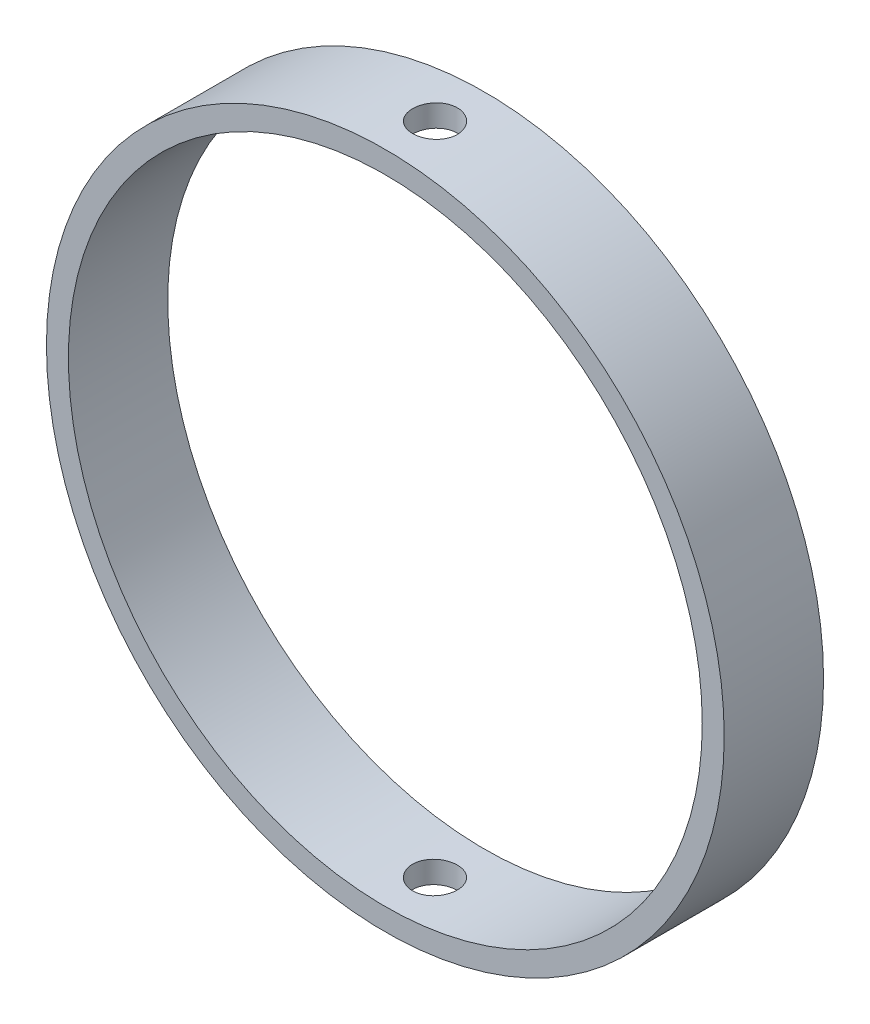
ISO-10303-21;
HEADER;
FILE_DESCRIPTION(('STEP AP214'),'2;1');
FILE_NAME('part.step','',(''),(''),'','','');
FILE_SCHEMA(('AUTOMOTIVE_DESIGN { 1 0 10303 214 1 1 1 1 }'));
ENDSEC;
DATA;
#1=APPLICATION_CONTEXT('core data for automotive mechanical design processes');
#2=APPLICATION_PROTOCOL_DEFINITION('international standard','automotive_design',2000,#1);
#3=PRODUCT_CONTEXT('',#1,'mechanical');
#4=PRODUCT('Part','Part','',(#3));
#5=PRODUCT_RELATED_PRODUCT_CATEGORY('part','',(#4));
#6=PRODUCT_DEFINITION_FORMATION('','',#4);
#7=PRODUCT_DEFINITION_CONTEXT('part definition',#1,'design');
#8=PRODUCT_DEFINITION('design','',#6,#7);
#9=PRODUCT_DEFINITION_SHAPE('','',#8);
#10=(LENGTH_UNIT() NAMED_UNIT(*) SI_UNIT(.MILLI.,.METRE.));
#11=(NAMED_UNIT(*) PLANE_ANGLE_UNIT() SI_UNIT($,.RADIAN.));
#12=(NAMED_UNIT(*) SI_UNIT($,.STERADIAN.) SOLID_ANGLE_UNIT());
#13=UNCERTAINTY_MEASURE_WITH_UNIT(LENGTH_MEASURE(1.E-05),#10,'distance_accuracy_value','');
#14=(GEOMETRIC_REPRESENTATION_CONTEXT(3) GLOBAL_UNCERTAINTY_ASSIGNED_CONTEXT((#13)) GLOBAL_UNIT_ASSIGNED_CONTEXT((#10,
#11,#12)) REPRESENTATION_CONTEXT('',''));
#15=CARTESIAN_POINT('',(0.,0.,0.));
#16=DIRECTION('',(0.,0.,1.));
#17=DIRECTION('',(1.,0.,0.));
#18=AXIS2_PLACEMENT_3D('',#15,#16,#17);
#19=CARTESIAN_POINT('',(0.,0.,10.));
#20=DIRECTION('',(0.,0.,1.));
#21=DIRECTION('',(1.,0.,0.));
#22=AXIS2_PLACEMENT_3D('',#19,#20,#21);
#23=PLANE('',#22);
#24=CARTESIAN_POINT('',(0.,0.,10.));
#25=DIRECTION('',(0.,0.,1.));
#26=DIRECTION('',(1.,0.,0.));
#27=AXIS2_PLACEMENT_3D('',#24,#25,#26);
#28=CIRCLE('',#27,34.11);
#29=CARTESIAN_POINT('',(34.11,0.,10.));
#30=VERTEX_POINT('',#29);
#31=EDGE_CURVE('E10',#30,#30,#28,.T.);
#32=ORIENTED_EDGE('',*,*,#31,.T.);
#33=EDGE_LOOP('',(#32));
#34=FACE_BOUND('',#33,.T.);
#35=CARTESIAN_POINT('',(0.,0.,10.));
#36=DIRECTION('',(0.,0.,1.));
#37=DIRECTION('',(1.,0.,0.));
#38=AXIS2_PLACEMENT_3D('',#35,#36,#37);
#39=CIRCLE('',#38,31.9);
#40=CARTESIAN_POINT('',(31.9,0.,10.));
#41=VERTEX_POINT('',#40);
#42=EDGE_CURVE('E55',#41,#41,#39,.T.);
#43=ORIENTED_EDGE('',*,*,#42,.F.);
#44=EDGE_LOOP('',(#43));
#45=FACE_BOUND('',#44,.T.);
#46=ADVANCED_FACE('F36',(#34,#45),#23,.T.);
#47=CARTESIAN_POINT('',(0.,0.,0.));
#48=DIRECTION('',(0.,0.,1.));
#49=DIRECTION('',(1.,0.,0.));
#50=AXIS2_PLACEMENT_3D('',#47,#48,#49);
#51=PLANE('',#50);
#52=CARTESIAN_POINT('',(0.,0.,0.));
#53=DIRECTION('',(0.,0.,1.));
#54=DIRECTION('',(1.,0.,0.));
#55=AXIS2_PLACEMENT_3D('',#52,#53,#54);
#56=CIRCLE('',#55,34.11);
#57=CARTESIAN_POINT('',(34.11,0.,0.));
#58=VERTEX_POINT('',#57);
#59=EDGE_CURVE('E50',#58,#58,#56,.T.);
#60=ORIENTED_EDGE('',*,*,#59,.F.);
#61=EDGE_LOOP('',(#60));
#62=FACE_BOUND('',#61,.T.);
#63=CARTESIAN_POINT('',(0.,0.,0.));
#64=DIRECTION('',(0.,0.,1.));
#65=DIRECTION('',(1.,0.,0.));
#66=AXIS2_PLACEMENT_3D('',#63,#64,#65);
#67=CIRCLE('',#66,31.9);
#68=CARTESIAN_POINT('',(31.9,0.,0.));
#69=VERTEX_POINT('',#68);
#70=EDGE_CURVE('E58',#69,#69,#67,.T.);
#71=ORIENTED_EDGE('',*,*,#70,.T.);
#72=EDGE_LOOP('',(#71));
#73=FACE_BOUND('',#72,.T.);
#74=ADVANCED_FACE('F94',(#62,#73),#51,.F.);
#75=CARTESIAN_POINT('',(0.,0.,10.));
#76=DIRECTION('',(0.,0.,-1.));
#77=DIRECTION('',(-1.,0.,0.));
#78=AXIS2_PLACEMENT_3D('',#75,#76,#77);
#79=CYLINDRICAL_SURFACE('',#78,34.11);
#80=CARTESIAN_POINT('',(0.,-34.11,7.25));
#81=CARTESIAN_POINT('',(0.126236232067112,-34.1099990155322,7.24999445119093));
#82=CARTESIAN_POINT('',(0.252560495104078,-34.1092917357394,7.23934057154602));
#83=CARTESIAN_POINT('',(0.50171989079194,-34.1065382541149,7.19699363139113));
#84=CARTESIAN_POINT('',(0.624550805850633,-34.1044905000079,7.16527617855028));
#85=CARTESIAN_POINT('',(0.863078424326583,-34.0992876891452,7.08171796852339));
#86=CARTESIAN_POINT('',(0.978778893213271,-34.0961332228197,7.02988793982208));
#87=CARTESIAN_POINT('',(1.19980776719596,-34.0890716251194,6.90759350935407));
#88=CARTESIAN_POINT('',(1.30513851721244,-34.0851646645008,6.83713333379523));
#89=CARTESIAN_POINT('',(1.50264187295735,-34.0770299110278,6.67945155950877));
#90=CARTESIAN_POINT('',(1.59479506690922,-34.0728016586297,6.59220566835798));
#91=CARTESIAN_POINT('',(1.76316130484982,-34.064504782304,6.4034793961004));
#92=CARTESIAN_POINT('',(1.83937367791159,-34.0604361651012,6.30199841615874));
#93=CARTESIAN_POINT('',(1.97375593047256,-34.0529137938074,6.08757112706869));
#94=CARTESIAN_POINT('',(2.03190949037146,-34.0494605970605,5.9746145691447));
#95=CARTESIAN_POINT('',(2.12841896738848,-34.0435645020074,5.74051432500948));
#96=CARTESIAN_POINT('',(2.16677511733114,-34.0411215918201,5.61937073509959));
#97=CARTESIAN_POINT('',(2.2225465965421,-34.0375259775116,5.37252387964667));
#98=CARTESIAN_POINT('',(2.23999259764253,-34.0363713838091,5.24682757192913));
#99=CARTESIAN_POINT('',(2.25354324621545,-34.0354769504881,4.99428572088538));
#100=CARTESIAN_POINT('',(2.24964815860565,-34.0357370933078,4.86744019184455));
#101=CARTESIAN_POINT('',(2.22065263136083,-34.0376410428115,4.61640974726707));
#102=CARTESIAN_POINT('',(2.19558540316304,-34.0392826824118,4.49222097688771));
#103=CARTESIAN_POINT('',(2.12500868744147,-34.0437612178655,4.2498176945186));
#104=CARTESIAN_POINT('',(2.07949906606268,-34.0465981215455,4.13160322165366));
#105=CARTESIAN_POINT('',(1.96929178788083,-34.0531499881129,3.90439763600856));
#106=CARTESIAN_POINT('',(1.9045790896307,-34.0568656388432,3.79541383980074));
#107=CARTESIAN_POINT('',(1.75781350418989,-34.0647556021647,3.58984324955986));
#108=CARTESIAN_POINT('',(1.67576039913157,-34.0689299205185,3.49325661131118));
#109=CARTESIAN_POINT('',(1.49645624853778,-34.0772764412141,3.3150288655114));
#110=CARTESIAN_POINT('',(1.3991764650823,-34.0814486242749,3.23341666573886));
#111=CARTESIAN_POINT('',(1.19228104771026,-34.0893130552533,3.08767752418783));
#112=CARTESIAN_POINT('',(1.08266540900876,-34.0930053029847,3.02355058919169));
#113=CARTESIAN_POINT('',(0.854192149451793,-34.0994941584408,2.91460465771204));
#114=CARTESIAN_POINT('',(0.735333991988551,-34.1022907141147,2.86978678327523));
#115=CARTESIAN_POINT('',(0.491757589300713,-34.106672379113,2.80075063447031));
#116=CARTESIAN_POINT('',(0.367039420314796,-34.1082575041936,2.7765320921834));
#117=CARTESIAN_POINT('',(0.115534063197057,-34.1100356648865,2.74941796520279));
#118=CARTESIAN_POINT('',(-0.0112487991028989,-34.110231309442,2.74648241850394));
#119=CARTESIAN_POINT('',(-0.263505091974206,-34.1092154070142,2.76191315775841));
#120=CARTESIAN_POINT('',(-0.388978530143297,-34.1080038682005,2.78027932004229));
#121=CARTESIAN_POINT('',(-0.634941467304668,-34.104311646189,2.8377590358186));
#122=CARTESIAN_POINT('',(-0.755435275692361,-34.1018320863009,2.87685422708602));
#123=CARTESIAN_POINT('',(-0.988151655969573,-34.0958827186364,2.97466356712522));
#124=CARTESIAN_POINT('',(-1.10037414507042,-34.0924129009502,3.03337791223506));
#125=CARTESIAN_POINT('',(-1.31354513573504,-34.0848662599385,3.16886041266616));
#126=CARTESIAN_POINT('',(-1.41447666241317,-34.0807885436048,3.24565522614064));
#127=CARTESIAN_POINT('',(-1.6020297015385,-34.0724878953657,3.41507998108745));
#128=CARTESIAN_POINT('',(-1.68865105743697,-34.0682649618723,3.50771009577039));
#129=CARTESIAN_POINT('',(-1.84526051352104,-34.0601422489328,3.70634858290552));
#130=CARTESIAN_POINT('',(-1.91522266570183,-34.0562429796926,3.81237743685333));
#131=CARTESIAN_POINT('',(-2.03635019259243,-34.0492154796992,4.03470084009306));
#132=CARTESIAN_POINT('',(-2.08751569388909,-34.0460872437534,4.15099532024412));
#133=CARTESIAN_POINT('',(-2.16955269176884,-34.040958284317,4.39045445078552));
#134=CARTESIAN_POINT('',(-2.20044045422451,-34.0389566572967,4.51361350847123));
#135=CARTESIAN_POINT('',(-2.24109828405931,-34.0363041476612,4.76338328521924));
#136=CARTESIAN_POINT('',(-2.25086858953727,-34.0356532498165,4.88999396534827));
#137=CARTESIAN_POINT('',(-2.24901181211322,-34.0357759725338,5.14281499777431));
#138=CARTESIAN_POINT('',(-2.23742551865171,-34.0365468775646,5.26902565297988));
#139=CARTESIAN_POINT('',(-2.19326907600514,-34.0394205810851,5.51770518337966));
#140=CARTESIAN_POINT('',(-2.16069888953255,-34.0415233819414,5.64017405192446));
#141=CARTESIAN_POINT('',(-2.07550858311604,-34.0468232439607,5.87789915074719));
#142=CARTESIAN_POINT('',(-2.02288872386212,-34.050020290896,5.99315547478143));
#143=CARTESIAN_POINT('',(-1.89909813886069,-34.0571483411618,6.21320330126454));
#144=CARTESIAN_POINT('',(-1.82792786571145,-34.0610793265848,6.31799505894459));
#145=CARTESIAN_POINT('',(-1.66890525190004,-34.0692410755978,6.51434641079598));
#146=CARTESIAN_POINT('',(-1.58102325506209,-34.0734723636009,6.60588196432118));
#147=CARTESIAN_POINT('',(-1.3911148762501,-34.0817533708888,6.77293364594129));
#148=CARTESIAN_POINT('',(-1.28908504468532,-34.0858030455721,6.84844585575375));
#149=CARTESIAN_POINT('',(-1.07364950775414,-34.0932691498918,6.98136947670146));
#150=CARTESIAN_POINT('',(-0.96022888841919,-34.0966847322054,7.03875673864628));
#151=CARTESIAN_POINT('',(-0.725421417636047,-34.102486693718,7.13360267875823));
#152=CARTESIAN_POINT('',(-0.60404405806956,-34.10487427441,7.17108463359364));
#153=CARTESIAN_POINT('',(-0.401606581873306,-34.107727393871,7.21534271994654));
#154=CARTESIAN_POINT('',(-0.321854098256995,-34.1085758202575,7.22832232637886));
#155=CARTESIAN_POINT('',(-0.161413074793423,-34.1097124376555,7.24565273383906));
#156=CARTESIAN_POINT('',(-0.080724536404456,-34.1100006295396,7.25000354830806));
#157=CARTESIAN_POINT('',(0.,-34.11,7.25));
#158=B_SPLINE_CURVE_WITH_KNOTS('',3,(#80,#81,#82,#83,#84,#85,#86,#87,#88,#89,#90,#91,#92,#93,
#94,#95,#96,#97,#98,#99,#100,#101,#102,#103,#104,#105,#106,#107,#108,#109,#110,#111,#112,#113,
#114,#115,#116,#117,#118,#119,#120,#121,#122,#123,#124,#125,#126,#127,#128,#129,#130,#131,#132,
#133,#134,#135,#136,#137,#138,#139,#140,#141,#142,#143,#144,#145,#146,#147,#148,#149,#150,#151,
#152,#153,#154,#155,#156,#157),.UNSPECIFIED.,.T.,.F.,(4,2,2,2,2,2,2,2,2,2,2,2,2,2,2,2,2,2,2,2,2,
2,2,2,2,2,2,2,2,2,2,2,2,2,2,2,2,2,4),(0.,0.378413997932965,0.757266978017366,1.13591814687722,
1.51448349313684,1.89360088027578,2.27273422072863,2.65220919044171,3.03167969729307,
3.41059289792741,3.78950139493146,4.16781662295322,4.54613432818601,4.92474914904057,
5.30336872715503,5.6827117024731,6.06205482493419,6.44141998799654,6.82078021688864,
7.19942795533425,7.57807349550936,7.95638418221594,8.33469865496781,8.71357445335855,
9.09245439625595,9.47192066941759,9.85138438700034,10.2305433430481,10.6096980240651,
10.9881292993949,11.3665612471837,11.7449882746898,12.12340607009,12.5025017703522,
12.8816900665552,13.2613814722591,13.6406278950902,13.8826134299535,14.1245985878744),.UNSPECIFIED.);
#159=CARTESIAN_POINT('',(0.,-34.11,7.25));
#160=VERTEX_POINT('',#159);
#161=EDGE_CURVE('E83',#160,#160,#158,.T.);
#162=ORIENTED_EDGE('',*,*,#161,.T.);
#163=EDGE_LOOP('',(#162));
#164=FACE_BOUND('',#163,.T.);
#165=CARTESIAN_POINT('',(0.,34.11,7.25));
#166=CARTESIAN_POINT('',(-0.126236232067112,34.1099990155322,7.24999445119093));
#167=CARTESIAN_POINT('',(-0.252560495104078,34.1092917357394,7.23934057154602));
#168=CARTESIAN_POINT('',(-0.50171989079194,34.1065382541149,7.19699363139113));
#169=CARTESIAN_POINT('',(-0.624550805850633,34.1044905000079,7.16527617855028));
#170=CARTESIAN_POINT('',(-0.863078424326583,34.0992876891452,7.08171796852339));
#171=CARTESIAN_POINT('',(-0.978778893213271,34.0961332228197,7.02988793982208));
#172=CARTESIAN_POINT('',(-1.19980776719596,34.0890716251194,6.90759350935407));
#173=CARTESIAN_POINT('',(-1.30513851721244,34.0851646645008,6.83713333379523));
#174=CARTESIAN_POINT('',(-1.50264187295735,34.0770299110278,6.67945155950877));
#175=CARTESIAN_POINT('',(-1.59479506690922,34.0728016586297,6.59220566835798));
#176=CARTESIAN_POINT('',(-1.76316130484982,34.064504782304,6.4034793961004));
#177=CARTESIAN_POINT('',(-1.83937367791159,34.0604361651012,6.30199841615874));
#178=CARTESIAN_POINT('',(-1.97375593047256,34.0529137938074,6.08757112706869));
#179=CARTESIAN_POINT('',(-2.03190949037146,34.0494605970605,5.9746145691447));
#180=CARTESIAN_POINT('',(-2.12841896738848,34.0435645020074,5.74051432500948));
#181=CARTESIAN_POINT('',(-2.16677511733114,34.0411215918201,5.61937073509959));
#182=CARTESIAN_POINT('',(-2.2225465965421,34.0375259775116,5.37252387964667));
#183=CARTESIAN_POINT('',(-2.23999259764253,34.0363713838091,5.24682757192913));
#184=CARTESIAN_POINT('',(-2.25354324621545,34.0354769504881,4.99428572088538));
#185=CARTESIAN_POINT('',(-2.24964815860565,34.0357370933078,4.86744019184455));
#186=CARTESIAN_POINT('',(-2.22065263136083,34.0376410428115,4.61640974726707));
#187=CARTESIAN_POINT('',(-2.19558540316304,34.0392826824118,4.49222097688771));
#188=CARTESIAN_POINT('',(-2.12500868744147,34.0437612178655,4.2498176945186));
#189=CARTESIAN_POINT('',(-2.07949906606268,34.0465981215455,4.13160322165366));
#190=CARTESIAN_POINT('',(-1.96929178788083,34.0531499881129,3.90439763600856));
#191=CARTESIAN_POINT('',(-1.9045790896307,34.0568656388432,3.79541383980074));
#192=CARTESIAN_POINT('',(-1.75781350418989,34.0647556021647,3.58984324955986));
#193=CARTESIAN_POINT('',(-1.67576039913157,34.0689299205185,3.49325661131118));
#194=CARTESIAN_POINT('',(-1.49645624853778,34.0772764412141,3.3150288655114));
#195=CARTESIAN_POINT('',(-1.3991764650823,34.0814486242749,3.23341666573886));
#196=CARTESIAN_POINT('',(-1.19228104771026,34.0893130552533,3.08767752418783));
#197=CARTESIAN_POINT('',(-1.08266540900876,34.0930053029847,3.02355058919169));
#198=CARTESIAN_POINT('',(-0.854192149451793,34.0994941584408,2.91460465771204));
#199=CARTESIAN_POINT('',(-0.735333991988551,34.1022907141147,2.86978678327523));
#200=CARTESIAN_POINT('',(-0.491757589300713,34.106672379113,2.80075063447031));
#201=CARTESIAN_POINT('',(-0.367039420314796,34.1082575041936,2.7765320921834));
#202=CARTESIAN_POINT('',(-0.115534063197057,34.1100356648865,2.74941796520279));
#203=CARTESIAN_POINT('',(0.0112487991028989,34.110231309442,2.74648241850394));
#204=CARTESIAN_POINT('',(0.263505091974206,34.1092154070142,2.76191315775841));
#205=CARTESIAN_POINT('',(0.388978530143297,34.1080038682005,2.78027932004229));
#206=CARTESIAN_POINT('',(0.634941467304668,34.104311646189,2.8377590358186));
#207=CARTESIAN_POINT('',(0.755435275692361,34.1018320863009,2.87685422708602));
#208=CARTESIAN_POINT('',(0.988151655969573,34.0958827186364,2.97466356712522));
#209=CARTESIAN_POINT('',(1.10037414507042,34.0924129009502,3.03337791223506));
#210=CARTESIAN_POINT('',(1.31354513573504,34.0848662599385,3.16886041266616));
#211=CARTESIAN_POINT('',(1.41447666241317,34.0807885436048,3.24565522614064));
#212=CARTESIAN_POINT('',(1.6020297015385,34.0724878953657,3.41507998108745));
#213=CARTESIAN_POINT('',(1.68865105743697,34.0682649618723,3.50771009577039));
#214=CARTESIAN_POINT('',(1.84526051352104,34.0601422489328,3.70634858290552));
#215=CARTESIAN_POINT('',(1.91522266570183,34.0562429796926,3.81237743685333));
#216=CARTESIAN_POINT('',(2.03635019259243,34.0492154796992,4.03470084009306));
#217=CARTESIAN_POINT('',(2.08751569388909,34.0460872437534,4.15099532024412));
#218=CARTESIAN_POINT('',(2.16955269176884,34.040958284317,4.39045445078552));
#219=CARTESIAN_POINT('',(2.20044045422451,34.0389566572967,4.51361350847123));
#220=CARTESIAN_POINT('',(2.24109828405931,34.0363041476612,4.76338328521924));
#221=CARTESIAN_POINT('',(2.25086858953727,34.0356532498165,4.88999396534827));
#222=CARTESIAN_POINT('',(2.24901181211322,34.0357759725338,5.14281499777431));
#223=CARTESIAN_POINT('',(2.23742551865171,34.0365468775646,5.26902565297988));
#224=CARTESIAN_POINT('',(2.19326907600514,34.0394205810851,5.51770518337966));
#225=CARTESIAN_POINT('',(2.16069888953255,34.0415233819414,5.64017405192446));
#226=CARTESIAN_POINT('',(2.07550858311604,34.0468232439607,5.87789915074719));
#227=CARTESIAN_POINT('',(2.02288872386212,34.050020290896,5.99315547478143));
#228=CARTESIAN_POINT('',(1.89909813886069,34.0571483411618,6.21320330126454));
#229=CARTESIAN_POINT('',(1.82792786571145,34.0610793265848,6.31799505894459));
#230=CARTESIAN_POINT('',(1.66890525190004,34.0692410755978,6.51434641079598));
#231=CARTESIAN_POINT('',(1.58102325506209,34.0734723636009,6.60588196432118));
#232=CARTESIAN_POINT('',(1.3911148762501,34.0817533708888,6.77293364594129));
#233=CARTESIAN_POINT('',(1.28908504468532,34.0858030455721,6.84844585575375));
#234=CARTESIAN_POINT('',(1.07364950775414,34.0932691498918,6.98136947670146));
#235=CARTESIAN_POINT('',(0.96022888841919,34.0966847322054,7.03875673864628));
#236=CARTESIAN_POINT('',(0.725421417636047,34.102486693718,7.13360267875823));
#237=CARTESIAN_POINT('',(0.60404405806956,34.10487427441,7.17108463359364));
#238=CARTESIAN_POINT('',(0.401606581873306,34.107727393871,7.21534271994654));
#239=CARTESIAN_POINT('',(0.321854098256995,34.1085758202575,7.22832232637886));
#240=CARTESIAN_POINT('',(0.161413074793423,34.1097124376555,7.24565273383906));
#241=CARTESIAN_POINT('',(0.080724536404456,34.1100006295396,7.25000354830806));
#242=CARTESIAN_POINT('',(0.,34.11,7.25));
#243=B_SPLINE_CURVE_WITH_KNOTS('',3,(#165,#166,#167,#168,#169,#170,#171,#172,#173,#174,#175,
#176,#177,#178,#179,#180,#181,#182,#183,#184,#185,#186,#187,#188,#189,#190,#191,#192,#193,#194,
#195,#196,#197,#198,#199,#200,#201,#202,#203,#204,#205,#206,#207,#208,#209,#210,#211,#212,#213,
#214,#215,#216,#217,#218,#219,#220,#221,#222,#223,#224,#225,#226,#227,#228,#229,#230,#231,#232,
#233,#234,#235,#236,#237,#238,#239,#240,#241,#242),.UNSPECIFIED.,.T.,.F.,(4,2,2,2,2,2,2,2,2,2,2,
2,2,2,2,2,2,2,2,2,2,2,2,2,2,2,2,2,2,2,2,2,2,2,2,2,2,2,4),(0.,0.378413997932965,
0.757266978017366,1.13591814687722,1.51448349313684,1.89360088027578,2.27273422072863,
2.65220919044171,3.03167969729307,3.41059289792741,3.78950139493146,4.16781662295322,
4.54613432818601,4.92474914904057,5.30336872715503,5.6827117024731,6.06205482493419,
6.44141998799654,6.82078021688864,7.19942795533425,7.57807349550936,7.95638418221594,
8.33469865496781,8.71357445335855,9.09245439625595,9.47192066941759,9.85138438700034,
10.2305433430481,10.6096980240651,10.9881292993949,11.3665612471837,11.7449882746898,
12.12340607009,12.5025017703522,12.8816900665552,13.2613814722591,13.6406278950902,
13.8826134299535,14.1245985878744),.UNSPECIFIED.);
#244=CARTESIAN_POINT('',(0.,34.11,7.25));
#245=VERTEX_POINT('',#244);
#246=EDGE_CURVE('E78',#245,#245,#243,.T.);
#247=ORIENTED_EDGE('',*,*,#246,.T.);
#248=EDGE_LOOP('',(#247));
#249=FACE_BOUND('',#248,.T.);
#250=ORIENTED_EDGE('',*,*,#31,.F.);
#251=EDGE_LOOP('',(#250));
#252=FACE_BOUND('',#251,.T.);
#253=ORIENTED_EDGE('',*,*,#59,.T.);
#254=EDGE_LOOP('',(#253));
#255=FACE_BOUND('',#254,.T.);
#256=ADVANCED_FACE('F38',(#164,#249,#252,#255),#79,.T.);
#257=CARTESIAN_POINT('',(0.,0.,10.));
#258=DIRECTION('',(0.,0.,-1.));
#259=DIRECTION('',(-1.,0.,0.));
#260=AXIS2_PLACEMENT_3D('',#257,#258,#259);
#261=CYLINDRICAL_SURFACE('',#260,31.9);
#262=CARTESIAN_POINT('',(0.,-31.9,7.25));
#263=CARTESIAN_POINT('',(0.12621516261996,-31.8999989504168,7.24999446015859));
#264=CARTESIAN_POINT('',(0.252517838243733,-31.8992429258965,7.23934412188015));
#265=CARTESIAN_POINT('',(0.501633210294184,-31.8962996793697,7.19701206942383));
#266=CARTESIAN_POINT('',(0.624441712248858,-31.8941108072079,7.1653061056837));
#267=CARTESIAN_POINT('',(0.862924399227038,-31.8885493917217,7.08178019698933));
#268=CARTESIAN_POINT('',(0.978602404918668,-31.8851774888868,7.02997113419122));
#269=CARTESIAN_POINT('',(1.19959077145544,-31.8776288677882,6.90772800183945));
#270=CARTESIAN_POINT('',(1.30490344417679,-31.8734523296071,6.83729809844125));
#271=CARTESIAN_POINT('',(1.50239776872852,-31.8647548932516,6.67966933678473));
#272=CARTESIAN_POINT('',(1.59455744890959,-31.860233437794,6.59244297849141));
#273=CARTESIAN_POINT('',(1.76294153900917,-31.8513604880078,6.40375470293454));
#274=CARTESIAN_POINT('',(1.83916527132545,-31.8470090009128,6.30229218065061));
#275=CARTESIAN_POINT('',(1.97358449239678,-31.8389622901035,6.08788338934675));
#276=CARTESIAN_POINT('',(2.03176125142315,-31.835267749875,5.97492535025403));
#277=CARTESIAN_POINT('',(2.12831535820395,-31.8289589604278,5.74081431590923));
#278=CARTESIAN_POINT('',(2.16669296679221,-31.8263446969776,5.6196614286398));
#279=CARTESIAN_POINT('',(2.22249713733363,-31.8224966923515,5.3728154099356));
#280=CARTESIAN_POINT('',(2.23995875986717,-31.821260641178,5.24713024119583));
#281=CARTESIAN_POINT('',(2.25354354947647,-31.8203015412817,4.99460721128955));
#282=CARTESIAN_POINT('',(2.24966701400161,-31.8205784714682,4.86776936621571));
#283=CARTESIAN_POINT('',(2.22071457383843,-31.8226119614253,4.61678082146072));
#284=CARTESIAN_POINT('',(2.19567666504032,-31.8243658692171,4.4926257143382));
#285=CARTESIAN_POINT('',(2.12517118183888,-31.8291515034077,4.25028483612998));
#286=CARTESIAN_POINT('',(2.07970345777147,-31.8321832391675,4.13209910878163));
#287=CARTESIAN_POINT('',(1.96958607863432,-31.8391859484464,3.90493011622045));
#288=CARTESIAN_POINT('',(1.90491925401174,-31.8431577620196,3.79595520068209));
#289=CARTESIAN_POINT('',(1.75825174299386,-31.8515922434643,3.59039251817735));
#290=CARTESIAN_POINT('',(1.67625080670625,-31.8560549184116,3.49380492982161));
#291=CARTESIAN_POINT('',(1.49702909284475,-31.8649800279326,3.3155376529797));
#292=CARTESIAN_POINT('',(1.39977544482327,-31.8694424406665,3.23389100617853));
#293=CARTESIAN_POINT('',(1.19292401589542,-31.8778548315628,3.08807833783324));
#294=CARTESIAN_POINT('',(1.0833262294762,-31.8818048094964,3.02391232409596));
#295=CARTESIAN_POINT('',(0.854877053241173,-31.888747705225,2.91488489410464));
#296=CARTESIAN_POINT('',(0.736025028451733,-31.8917405572754,2.87002480389504));
#297=CARTESIAN_POINT('',(0.492450415204047,-31.8964311369075,2.80090507836016));
#298=CARTESIAN_POINT('',(0.36772791405821,-31.898128883745,2.77664513674813));
#299=CARTESIAN_POINT('',(0.116239341270491,-31.9000354768705,2.74945547134539));
#300=CARTESIAN_POINT('',(-0.0105217699023558,-31.9002475108538,2.74648007985634));
#301=CARTESIAN_POINT('',(-0.262741180396263,-31.8991672776853,2.7618245431177));
#302=CARTESIAN_POINT('',(-0.388199488375964,-31.8978750205378,2.7801442562459));
#303=CARTESIAN_POINT('',(-0.634122794288897,-31.8939336789138,2.83752107306146));
#304=CARTESIAN_POINT('',(-0.754592722266979,-31.8912859703909,2.87655714850419));
#305=CARTESIAN_POINT('',(-0.987271930786294,-31.8849314427975,2.97423720095806));
#306=CARTESIAN_POINT('',(-1.09948111697675,-31.8812246116324,3.03288140188272));
#307=CARTESIAN_POINT('',(-1.3126623089218,-31.8731600547057,3.16822874204364));
#308=CARTESIAN_POINT('',(-1.41361496315251,-31.8688012373099,3.24496229521092));
#309=CARTESIAN_POINT('',(-1.60122242132032,-31.8599266297643,3.41426600573597));
#310=CARTESIAN_POINT('',(-1.68787704685207,-31.8554108376567,3.50683636066998));
#311=CARTESIAN_POINT('',(-1.84458402967223,-31.8467219274899,3.705383376897));
#312=CARTESIAN_POINT('',(-1.91460669836616,-31.842549430771,3.8113835013925));
#313=CARTESIAN_POINT('',(-2.03585883696106,-31.8350276436787,4.03366358631524));
#314=CARTESIAN_POINT('',(-2.0870884482938,-31.8316783471101,4.14994346937145));
#315=CARTESIAN_POINT('',(-2.16924913257651,-31.8261851921021,4.38937504194059));
#316=CARTESIAN_POINT('',(-2.2001987107583,-31.8240402349773,4.51252035517803));
#317=CARTESIAN_POINT('',(-2.24098115610939,-31.8211946331349,4.76227526663464));
#318=CARTESIAN_POINT('',(-2.25081430144053,-31.820493969392,4.88888481919795));
#319=CARTESIAN_POINT('',(-2.24908191079637,-31.820616439543,5.1416791137753));
#320=CARTESIAN_POINT('',(-2.23756303733923,-31.8214362506064,5.26786417981797));
#321=CARTESIAN_POINT('',(-2.19355053112552,-31.8245002462812,5.51650342747345));
#322=CARTESIAN_POINT('',(-2.16105686221009,-31.8267444333481,5.63895760265412));
#323=CARTESIAN_POINT('',(-2.0760281599797,-31.8324034600638,5.8766645516856));
#324=CARTESIAN_POINT('',(-2.02349357074144,-31.8358182737732,5.99191748503926));
#325=CARTESIAN_POINT('',(-1.89988013437437,-31.8434337538433,6.21197424778426));
#326=CARTESIAN_POINT('',(-1.82880170066404,-31.8476344026838,6.31677831005188));
#327=CARTESIAN_POINT('',(-1.66994411253132,-31.8563590175734,6.51320010067539));
#328=CARTESIAN_POINT('',(-1.58213081102305,-31.8608836326736,6.6047901828962));
#329=CARTESIAN_POINT('',(-1.39235001057985,-31.8697405901661,6.77196326408218));
#330=CARTESIAN_POINT('',(-1.29037906767399,-31.8740728854354,6.84754235689983));
#331=CARTESIAN_POINT('',(-1.07503356585774,-31.8820626865595,6.9806194900229));
#332=CARTESIAN_POINT('',(-0.96164264769013,-31.8857192024842,7.03809109061726));
#333=CARTESIAN_POINT('',(-0.726875578955493,-31.8919328892518,7.13310852822749));
#334=CARTESIAN_POINT('',(-0.605508905632058,-31.8944913385864,7.17067755005914));
#335=CARTESIAN_POINT('',(-0.402840697900064,-31.8975549540542,7.21512774771704));
#336=CARTESIAN_POINT('',(-0.322846980842063,-31.8984677366803,7.22818776781458));
#337=CARTESIAN_POINT('',(-0.16191418162584,-31.8996905957953,7.24562566318172));
#338=CARTESIAN_POINT('',(-0.0809751011786317,-31.9000006733747,7.25000355416266));
#339=CARTESIAN_POINT('',(0.,-31.9,7.25));
#340=B_SPLINE_CURVE_WITH_KNOTS('',3,(#262,#263,#264,#265,#266,#267,#268,#269,#270,#271,#272,
#273,#274,#275,#276,#277,#278,#279,#280,#281,#282,#283,#284,#285,#286,#287,#288,#289,#290,#291,
#292,#293,#294,#295,#296,#297,#298,#299,#300,#301,#302,#303,#304,#305,#306,#307,#308,#309,#310,
#311,#312,#313,#314,#315,#316,#317,#318,#319,#320,#321,#322,#323,#324,#325,#326,#327,#328,#329,
#330,#331,#332,#333,#334,#335,#336,#337,#338,#339),.UNSPECIFIED.,.T.,.F.,(4,2,2,2,2,2,2,2,2,2,2,
2,2,2,2,2,2,2,2,2,2,2,2,2,2,2,2,2,2,2,2,2,2,2,2,2,2,2,4),(0.,0.378349866678817,0.75713623271223,
1.13571784052487,1.51421481751402,1.89333684106664,2.27247498174684,2.65200529782067,
3.03153061383769,3.41041885337317,3.7893018113007,4.16750591505964,4.54571278949901,
4.92425891440498,5.30281049688579,5.68218938231489,6.06156843717401,6.44097354586192,
6.82037301338709,7.19895820429505,7.57754087745233,7.95574000137064,8.33394344425318,
8.71278735999513,9.09163600244971,9.47115590378113,9.85067294888376,10.2298432062298,
10.6090084688239,10.9873460836634,11.3656843507283,11.7440142348723,12.1223356852096,
12.5014375206209,12.880631737997,13.2603770981745,13.6396791090243,13.882415191921,
14.1251508355575),.UNSPECIFIED.);
#341=CARTESIAN_POINT('',(0.,-31.9,7.25));
#342=VERTEX_POINT('',#341);
#343=EDGE_CURVE('E41',#342,#342,#340,.T.);
#344=ORIENTED_EDGE('',*,*,#343,.F.);
#345=EDGE_LOOP('',(#344));
#346=FACE_BOUND('',#345,.T.);
#347=CARTESIAN_POINT('',(0.,31.9,7.25));
#348=CARTESIAN_POINT('',(-0.12621516261996,31.8999989504168,7.24999446015859));
#349=CARTESIAN_POINT('',(-0.252517838243733,31.8992429258965,7.23934412188015));
#350=CARTESIAN_POINT('',(-0.501633210294184,31.8962996793697,7.19701206942383));
#351=CARTESIAN_POINT('',(-0.624441712248858,31.8941108072079,7.1653061056837));
#352=CARTESIAN_POINT('',(-0.862924399227038,31.8885493917217,7.08178019698933));
#353=CARTESIAN_POINT('',(-0.978602404918668,31.8851774888868,7.02997113419122));
#354=CARTESIAN_POINT('',(-1.19959077145544,31.8776288677882,6.90772800183945));
#355=CARTESIAN_POINT('',(-1.30490344417679,31.8734523296071,6.83729809844125));
#356=CARTESIAN_POINT('',(-1.50239776872852,31.8647548932516,6.67966933678473));
#357=CARTESIAN_POINT('',(-1.59455744890959,31.860233437794,6.59244297849141));
#358=CARTESIAN_POINT('',(-1.76294153900917,31.8513604880078,6.40375470293454));
#359=CARTESIAN_POINT('',(-1.83916527132545,31.8470090009128,6.30229218065061));
#360=CARTESIAN_POINT('',(-1.97358449239678,31.8389622901035,6.08788338934675));
#361=CARTESIAN_POINT('',(-2.03176125142315,31.835267749875,5.97492535025403));
#362=CARTESIAN_POINT('',(-2.12831535820395,31.8289589604278,5.74081431590923));
#363=CARTESIAN_POINT('',(-2.16669296679221,31.8263446969776,5.6196614286398));
#364=CARTESIAN_POINT('',(-2.22249713733363,31.8224966923515,5.3728154099356));
#365=CARTESIAN_POINT('',(-2.23995875986717,31.821260641178,5.24713024119583));
#366=CARTESIAN_POINT('',(-2.25354354947647,31.8203015412817,4.99460721128955));
#367=CARTESIAN_POINT('',(-2.24966701400161,31.8205784714682,4.86776936621571));
#368=CARTESIAN_POINT('',(-2.22071457383843,31.8226119614253,4.61678082146072));
#369=CARTESIAN_POINT('',(-2.19567666504032,31.8243658692171,4.4926257143382));
#370=CARTESIAN_POINT('',(-2.12517118183888,31.8291515034077,4.25028483612998));
#371=CARTESIAN_POINT('',(-2.07970345777147,31.8321832391675,4.13209910878163));
#372=CARTESIAN_POINT('',(-1.96958607863432,31.8391859484464,3.90493011622045));
#373=CARTESIAN_POINT('',(-1.90491925401174,31.8431577620196,3.79595520068209));
#374=CARTESIAN_POINT('',(-1.75825174299386,31.8515922434643,3.59039251817735));
#375=CARTESIAN_POINT('',(-1.67625080670625,31.8560549184116,3.49380492982161));
#376=CARTESIAN_POINT('',(-1.49702909284475,31.8649800279326,3.3155376529797));
#377=CARTESIAN_POINT('',(-1.39977544482327,31.8694424406665,3.23389100617853));
#378=CARTESIAN_POINT('',(-1.19292401589542,31.8778548315628,3.08807833783324));
#379=CARTESIAN_POINT('',(-1.0833262294762,31.8818048094964,3.02391232409596));
#380=CARTESIAN_POINT('',(-0.854877053241173,31.888747705225,2.91488489410464));
#381=CARTESIAN_POINT('',(-0.736025028451733,31.8917405572754,2.87002480389504));
#382=CARTESIAN_POINT('',(-0.492450415204047,31.8964311369075,2.80090507836016));
#383=CARTESIAN_POINT('',(-0.36772791405821,31.898128883745,2.77664513674813));
#384=CARTESIAN_POINT('',(-0.116239341270491,31.9000354768705,2.74945547134539));
#385=CARTESIAN_POINT('',(0.0105217699023558,31.9002475108538,2.74648007985634));
#386=CARTESIAN_POINT('',(0.262741180396263,31.8991672776853,2.7618245431177));
#387=CARTESIAN_POINT('',(0.388199488375964,31.8978750205378,2.7801442562459));
#388=CARTESIAN_POINT('',(0.634122794288897,31.8939336789138,2.83752107306146));
#389=CARTESIAN_POINT('',(0.754592722266979,31.8912859703909,2.87655714850419));
#390=CARTESIAN_POINT('',(0.987271930786294,31.8849314427975,2.97423720095806));
#391=CARTESIAN_POINT('',(1.09948111697675,31.8812246116324,3.03288140188272));
#392=CARTESIAN_POINT('',(1.3126623089218,31.8731600547057,3.16822874204364));
#393=CARTESIAN_POINT('',(1.41361496315251,31.8688012373099,3.24496229521092));
#394=CARTESIAN_POINT('',(1.60122242132032,31.8599266297643,3.41426600573597));
#395=CARTESIAN_POINT('',(1.68787704685207,31.8554108376567,3.50683636066998));
#396=CARTESIAN_POINT('',(1.84458402967223,31.8467219274899,3.705383376897));
#397=CARTESIAN_POINT('',(1.91460669836616,31.842549430771,3.8113835013925));
#398=CARTESIAN_POINT('',(2.03585883696106,31.8350276436787,4.03366358631524));
#399=CARTESIAN_POINT('',(2.0870884482938,31.8316783471101,4.14994346937145));
#400=CARTESIAN_POINT('',(2.16924913257651,31.8261851921021,4.38937504194059));
#401=CARTESIAN_POINT('',(2.2001987107583,31.8240402349773,4.51252035517803));
#402=CARTESIAN_POINT('',(2.24098115610939,31.8211946331349,4.76227526663464));
#403=CARTESIAN_POINT('',(2.25081430144053,31.820493969392,4.88888481919795));
#404=CARTESIAN_POINT('',(2.24908191079637,31.820616439543,5.1416791137753));
#405=CARTESIAN_POINT('',(2.23756303733923,31.8214362506064,5.26786417981797));
#406=CARTESIAN_POINT('',(2.19355053112552,31.8245002462812,5.51650342747345));
#407=CARTESIAN_POINT('',(2.16105686221009,31.8267444333481,5.63895760265412));
#408=CARTESIAN_POINT('',(2.0760281599797,31.8324034600638,5.8766645516856));
#409=CARTESIAN_POINT('',(2.02349357074144,31.8358182737732,5.99191748503926));
#410=CARTESIAN_POINT('',(1.89988013437437,31.8434337538433,6.21197424778426));
#411=CARTESIAN_POINT('',(1.82880170066404,31.8476344026838,6.31677831005188));
#412=CARTESIAN_POINT('',(1.66994411253132,31.8563590175734,6.51320010067539));
#413=CARTESIAN_POINT('',(1.58213081102305,31.8608836326736,6.6047901828962));
#414=CARTESIAN_POINT('',(1.39235001057985,31.8697405901661,6.77196326408218));
#415=CARTESIAN_POINT('',(1.29037906767399,31.8740728854354,6.84754235689983));
#416=CARTESIAN_POINT('',(1.07503356585774,31.8820626865595,6.9806194900229));
#417=CARTESIAN_POINT('',(0.96164264769013,31.8857192024842,7.03809109061726));
#418=CARTESIAN_POINT('',(0.726875578955493,31.8919328892518,7.13310852822749));
#419=CARTESIAN_POINT('',(0.605508905632058,31.8944913385864,7.17067755005914));
#420=CARTESIAN_POINT('',(0.402840697900064,31.8975549540542,7.21512774771704));
#421=CARTESIAN_POINT('',(0.322846980842063,31.8984677366803,7.22818776781458));
#422=CARTESIAN_POINT('',(0.16191418162584,31.8996905957953,7.24562566318172));
#423=CARTESIAN_POINT('',(0.0809751011786317,31.9000006733747,7.25000355416266));
#424=CARTESIAN_POINT('',(0.,31.9,7.25));
#425=B_SPLINE_CURVE_WITH_KNOTS('',3,(#347,#348,#349,#350,#351,#352,#353,#354,#355,#356,#357,
#358,#359,#360,#361,#362,#363,#364,#365,#366,#367,#368,#369,#370,#371,#372,#373,#374,#375,#376,
#377,#378,#379,#380,#381,#382,#383,#384,#385,#386,#387,#388,#389,#390,#391,#392,#393,#394,#395,
#396,#397,#398,#399,#400,#401,#402,#403,#404,#405,#406,#407,#408,#409,#410,#411,#412,#413,#414,
#415,#416,#417,#418,#419,#420,#421,#422,#423,#424),.UNSPECIFIED.,.T.,.F.,(4,2,2,2,2,2,2,2,2,2,2,
2,2,2,2,2,2,2,2,2,2,2,2,2,2,2,2,2,2,2,2,2,2,2,2,2,2,2,4),(0.,0.378349866678817,0.75713623271223,
1.13571784052487,1.51421481751402,1.89333684106664,2.27247498174684,2.65200529782067,
3.03153061383769,3.41041885337317,3.7893018113007,4.16750591505964,4.54571278949901,
4.92425891440498,5.30281049688579,5.68218938231489,6.06156843717401,6.44097354586192,
6.82037301338709,7.19895820429505,7.57754087745233,7.95574000137064,8.33394344425318,
8.71278735999513,9.09163600244971,9.47115590378113,9.85067294888376,10.2298432062298,
10.6090084688239,10.9873460836634,11.3656843507283,11.7440142348723,12.1223356852096,
12.5014375206209,12.880631737997,13.2603770981745,13.6396791090243,13.882415191921,
14.1251508355575),.UNSPECIFIED.);
#426=CARTESIAN_POINT('',(0.,31.9,7.25));
#427=VERTEX_POINT('',#426);
#428=EDGE_CURVE('E60',#427,#427,#425,.T.);
#429=ORIENTED_EDGE('',*,*,#428,.F.);
#430=EDGE_LOOP('',(#429));
#431=FACE_BOUND('',#430,.T.);
#432=ORIENTED_EDGE('',*,*,#42,.T.);
#433=EDGE_LOOP('',(#432));
#434=FACE_BOUND('',#433,.T.);
#435=ORIENTED_EDGE('',*,*,#70,.F.);
#436=EDGE_LOOP('',(#435));
#437=FACE_BOUND('',#436,.T.);
#438=ADVANCED_FACE('F65',(#346,#431,#434,#437),#261,.F.);
#439=CARTESIAN_POINT('',(0.,-34.11,5.));
#440=DIRECTION('',(0.,1.,0.));
#441=DIRECTION('',(0.,0.,1.));
#442=AXIS2_PLACEMENT_3D('',#439,#440,#441);
#443=CYLINDRICAL_SURFACE('',#442,2.25);
#444=ORIENTED_EDGE('',*,*,#428,.T.);
#445=EDGE_LOOP('',(#444));
#446=FACE_BOUND('',#445,.T.);
#447=ORIENTED_EDGE('',*,*,#246,.F.);
#448=EDGE_LOOP('',(#447));
#449=FACE_BOUND('',#448,.T.);
#450=ADVANCED_FACE('F71',(#446,#449),#443,.F.);
#451=ORIENTED_EDGE('',*,*,#343,.T.);
#452=EDGE_LOOP('',(#451));
#453=FACE_BOUND('',#452,.T.);
#454=ORIENTED_EDGE('',*,*,#161,.F.);
#455=EDGE_LOOP('',(#454));
#456=FACE_BOUND('',#455,.T.);
#457=ADVANCED_FACE('F68',(#453,#456),#443,.F.);
#458=CLOSED_SHELL('',(#46,#74,#256,#438,#450,#457));
#459=MANIFOLD_SOLID_BREP('B2',#458);
#460=ADVANCED_BREP_SHAPE_REPRESENTATION('',(#18,#459),#14);
#461=SHAPE_DEFINITION_REPRESENTATION(#9,#460);
ENDSEC;
END-ISO-10303-21;
